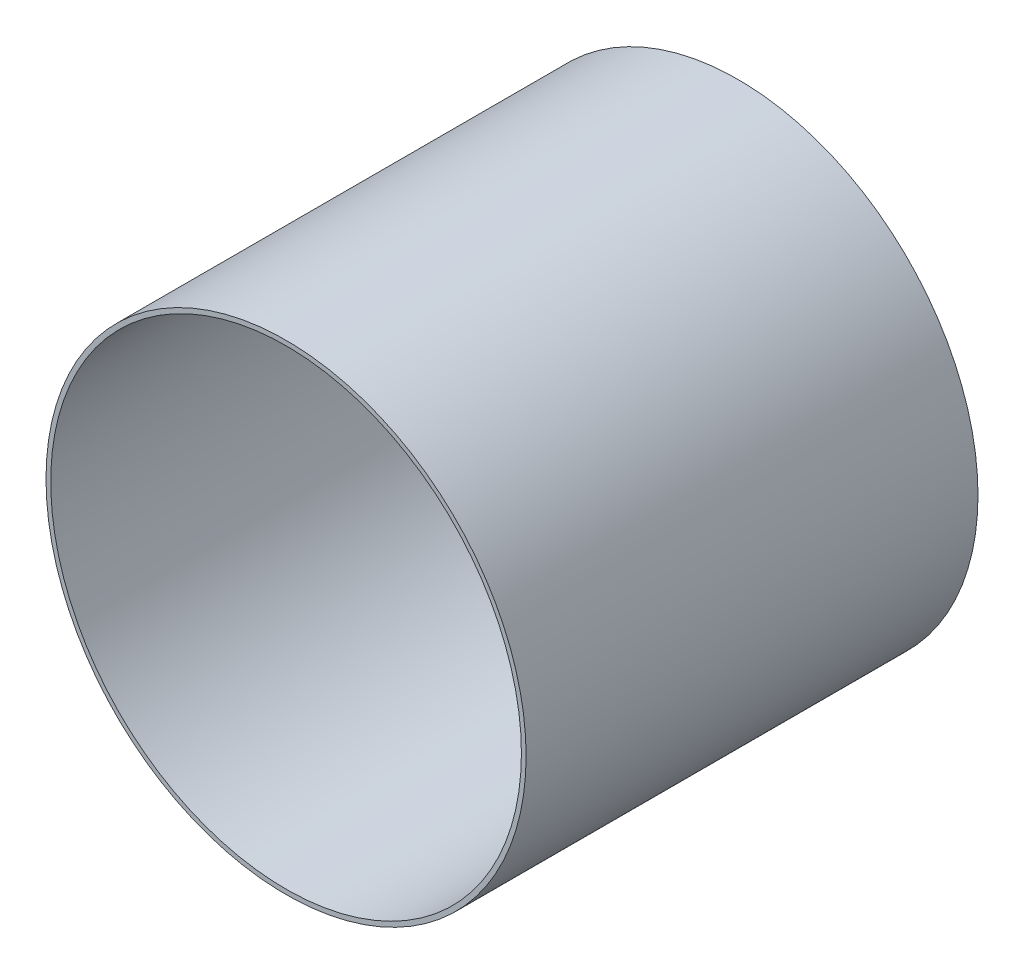
ISO-10303-21;
HEADER;
FILE_DESCRIPTION(('STEP AP214'),'2;1');
FILE_NAME('part.step','',(''),(''),'','','');
FILE_SCHEMA(('AUTOMOTIVE_DESIGN { 1 0 10303 214 1 1 1 1 }'));
ENDSEC;
DATA;
#1=APPLICATION_CONTEXT('core data for automotive mechanical design processes');
#2=APPLICATION_PROTOCOL_DEFINITION('international standard','automotive_design',2000,#1);
#3=PRODUCT_CONTEXT('',#1,'mechanical');
#4=PRODUCT('Part','Part','',(#3));
#5=PRODUCT_RELATED_PRODUCT_CATEGORY('part','',(#4));
#6=PRODUCT_DEFINITION_FORMATION('','',#4);
#7=PRODUCT_DEFINITION_CONTEXT('part definition',#1,'design');
#8=PRODUCT_DEFINITION('design','',#6,#7);
#9=PRODUCT_DEFINITION_SHAPE('','',#8);
#10=(LENGTH_UNIT() NAMED_UNIT(*) SI_UNIT(.MILLI.,.METRE.));
#11=(NAMED_UNIT(*) PLANE_ANGLE_UNIT() SI_UNIT($,.RADIAN.));
#12=(NAMED_UNIT(*) SI_UNIT($,.STERADIAN.) SOLID_ANGLE_UNIT());
#13=UNCERTAINTY_MEASURE_WITH_UNIT(LENGTH_MEASURE(1.E-05),#10,'distance_accuracy_value','');
#14=(GEOMETRIC_REPRESENTATION_CONTEXT(3) GLOBAL_UNCERTAINTY_ASSIGNED_CONTEXT((#13)) GLOBAL_UNIT_ASSIGNED_CONTEXT((#10,
#11,#12)) REPRESENTATION_CONTEXT('',''));
#15=CARTESIAN_POINT('',(0.,0.,0.));
#16=DIRECTION('',(0.,0.,1.));
#17=DIRECTION('',(1.,0.,0.));
#18=AXIS2_PLACEMENT_3D('',#15,#16,#17);
#19=CARTESIAN_POINT('',(0.,0.,-48.));
#20=DIRECTION('',(0.,0.,1.));
#21=DIRECTION('',(1.,0.,0.));
#22=AXIS2_PLACEMENT_3D('',#19,#20,#21);
#23=CYLINDRICAL_SURFACE('',#22,25.);
#24=CARTESIAN_POINT('',(0.,0.,-48.));
#25=DIRECTION('',(0.,0.,1.));
#26=DIRECTION('',(1.,0.,0.));
#27=AXIS2_PLACEMENT_3D('',#24,#25,#26);
#28=CIRCLE('',#27,25.);
#29=CARTESIAN_POINT('',(25.,0.,-48.));
#30=VERTEX_POINT('',#29);
#31=EDGE_CURVE('E42',#30,#30,#28,.T.);
#32=ORIENTED_EDGE('',*,*,#31,.F.);
#33=EDGE_LOOP('',(#32));
#34=FACE_BOUND('',#33,.T.);
#35=CARTESIAN_POINT('',(0.,0.,0.));
#36=DIRECTION('',(0.,0.,1.));
#37=DIRECTION('',(1.,0.,0.));
#38=AXIS2_PLACEMENT_3D('',#35,#36,#37);
#39=CIRCLE('',#38,25.);
#40=CARTESIAN_POINT('',(25.,0.,0.));
#41=VERTEX_POINT('',#40);
#42=EDGE_CURVE('E48',#41,#41,#39,.T.);
#43=ORIENTED_EDGE('',*,*,#42,.T.);
#44=EDGE_LOOP('',(#43));
#45=FACE_BOUND('',#44,.T.);
#46=ADVANCED_FACE('F35',(#34,#45),#23,.F.);
#47=CARTESIAN_POINT('',(0.,0.,-48.));
#48=DIRECTION('',(0.,0.,1.));
#49=DIRECTION('',(1.,0.,0.));
#50=AXIS2_PLACEMENT_3D('',#47,#48,#49);
#51=CYLINDRICAL_SURFACE('',#50,25.5);
#52=CARTESIAN_POINT('',(0.,0.,-48.));
#53=DIRECTION('',(0.,0.,1.));
#54=DIRECTION('',(1.,0.,0.));
#55=AXIS2_PLACEMENT_3D('',#52,#53,#54);
#56=CIRCLE('',#55,25.5);
#57=CARTESIAN_POINT('',(25.5,0.,-48.));
#58=VERTEX_POINT('',#57);
#59=EDGE_CURVE('E10',#58,#58,#56,.T.);
#60=ORIENTED_EDGE('',*,*,#59,.T.);
#61=EDGE_LOOP('',(#60));
#62=FACE_BOUND('',#61,.T.);
#63=CARTESIAN_POINT('',(0.,0.,0.));
#64=DIRECTION('',(0.,0.,1.));
#65=DIRECTION('',(1.,0.,0.));
#66=AXIS2_PLACEMENT_3D('',#63,#64,#65);
#67=CIRCLE('',#66,25.5);
#68=CARTESIAN_POINT('',(25.5,0.,0.));
#69=VERTEX_POINT('',#68);
#70=EDGE_CURVE('E38',#69,#69,#67,.T.);
#71=ORIENTED_EDGE('',*,*,#70,.F.);
#72=EDGE_LOOP('',(#71));
#73=FACE_BOUND('',#72,.T.);
#74=ADVANCED_FACE('F57',(#62,#73),#51,.T.);
#75=CARTESIAN_POINT('',(0.,0.,-48.));
#76=DIRECTION('',(0.,0.,1.));
#77=DIRECTION('',(1.,0.,0.));
#78=AXIS2_PLACEMENT_3D('',#75,#76,#77);
#79=PLANE('',#78);
#80=ORIENTED_EDGE('',*,*,#31,.T.);
#81=EDGE_LOOP('',(#80));
#82=FACE_BOUND('',#81,.T.);
#83=ORIENTED_EDGE('',*,*,#59,.F.);
#84=EDGE_LOOP('',(#83));
#85=FACE_BOUND('',#84,.T.);
#86=ADVANCED_FACE('F59',(#82,#85),#79,.F.);
#87=CARTESIAN_POINT('',(0.,0.,0.));
#88=DIRECTION('',(0.,0.,1.));
#89=DIRECTION('',(1.,0.,0.));
#90=AXIS2_PLACEMENT_3D('',#87,#88,#89);
#91=PLANE('',#90);
#92=ORIENTED_EDGE('',*,*,#42,.F.);
#93=EDGE_LOOP('',(#92));
#94=FACE_BOUND('',#93,.T.);
#95=ORIENTED_EDGE('',*,*,#70,.T.);
#96=EDGE_LOOP('',(#95));
#97=FACE_BOUND('',#96,.T.);
#98=ADVANCED_FACE('F55',(#94,#97),#91,.T.);
#99=CLOSED_SHELL('',(#46,#74,#86,#98));
#100=MANIFOLD_SOLID_BREP('B2',#99);
#101=ADVANCED_BREP_SHAPE_REPRESENTATION('',(#18,#100),#14);
#102=SHAPE_DEFINITION_REPRESENTATION(#9,#101);
ENDSEC;
END-ISO-10303-21;
